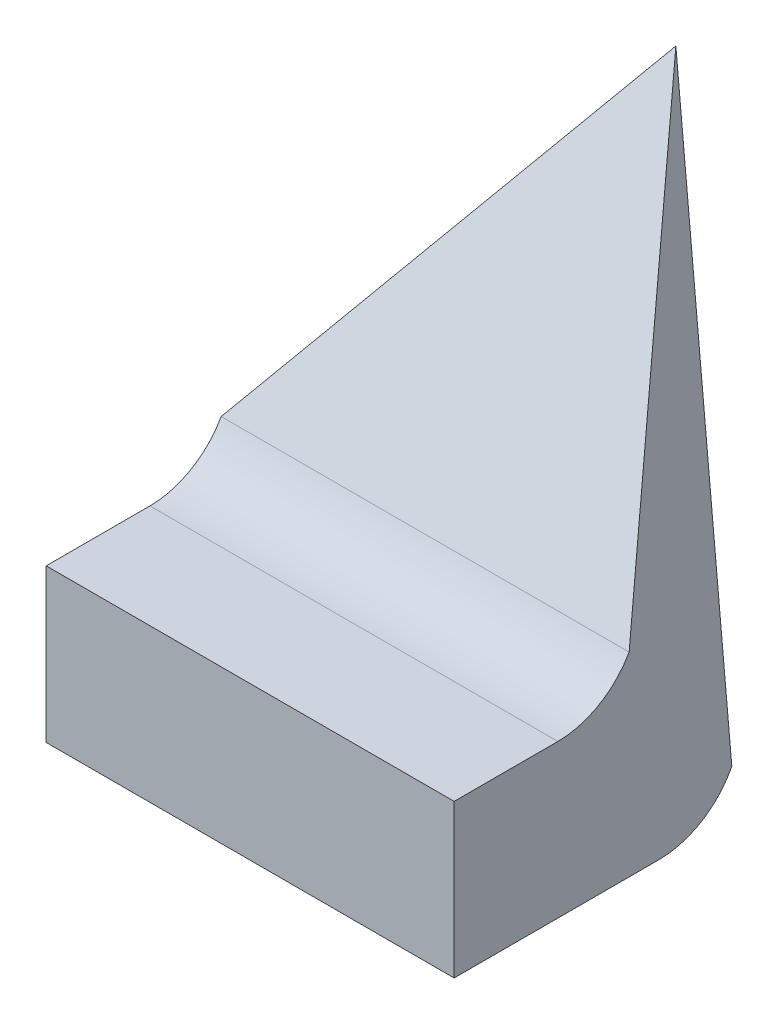
ISO-10303-21;
HEADER;
FILE_DESCRIPTION(('STEP AP214'),'2;1');
FILE_NAME('part.step','',(''),(''),'','','');
FILE_SCHEMA(('AUTOMOTIVE_DESIGN { 1 0 10303 214 1 1 1 1 }'));
ENDSEC;
DATA;
#1=APPLICATION_CONTEXT('core data for automotive mechanical design processes');
#2=APPLICATION_PROTOCOL_DEFINITION('international standard','automotive_design',2000,#1);
#3=PRODUCT_CONTEXT('',#1,'mechanical');
#4=PRODUCT('Part','Part','',(#3));
#5=PRODUCT_RELATED_PRODUCT_CATEGORY('part','',(#4));
#6=PRODUCT_DEFINITION_FORMATION('','',#4);
#7=PRODUCT_DEFINITION_CONTEXT('part definition',#1,'design');
#8=PRODUCT_DEFINITION('design','',#6,#7);
#9=PRODUCT_DEFINITION_SHAPE('','',#8);
#10=(LENGTH_UNIT() NAMED_UNIT(*) SI_UNIT(.MILLI.,.METRE.));
#11=(NAMED_UNIT(*) PLANE_ANGLE_UNIT() SI_UNIT($,.RADIAN.));
#12=(NAMED_UNIT(*) SI_UNIT($,.STERADIAN.) SOLID_ANGLE_UNIT());
#13=UNCERTAINTY_MEASURE_WITH_UNIT(LENGTH_MEASURE(1.E-05),#10,'distance_accuracy_value','');
#14=(GEOMETRIC_REPRESENTATION_CONTEXT(3) GLOBAL_UNCERTAINTY_ASSIGNED_CONTEXT((#13)) GLOBAL_UNIT_ASSIGNED_CONTEXT((#10,
#11,#12)) REPRESENTATION_CONTEXT('',''));
#15=CARTESIAN_POINT('',(0.,0.,0.));
#16=DIRECTION('',(0.,0.,1.));
#17=DIRECTION('',(1.,0.,0.));
#18=AXIS2_PLACEMENT_3D('',#15,#16,#17);
#19=CARTESIAN_POINT('',(-72.48907229268,21.89380350451,24.069563060296));
#20=DIRECTION('',(0.,0.455111059789055,0.890434682196108));
#21=DIRECTION('',(0.,-0.890434682196108,0.455111059789055));
#22=AXIS2_PLACEMENT_3D('',#19,#20,#21);
#23=PLANE('',#22);
#24=DIRECTION('',(1.,0.,0.));
#25=VECTOR('',#24,1.);
#26=CARTESIAN_POINT('',(-72.48907229268,21.8938035045101,24.0695630602962));
#27=LINE('',#26,#25);
#28=CARTESIAN_POINT('',(-72.48907229268,21.8938035045099,24.0695630602962));
#29=VERTEX_POINT('',#28);
#30=CARTESIAN_POINT('',(-72.08907229268,21.8938035045099,24.0695630602962));
#31=VERTEX_POINT('',#30);
#32=EDGE_CURVE('E83',#29,#31,#27,.T.);
#33=ORIENTED_EDGE('',*,*,#32,.F.);
#34=DIRECTION('',(0.,-0.890434682195813,0.455111059789631));
#35=VECTOR('',#34,1.);
#36=CARTESIAN_POINT('',(-72.48907229268,22.256621274076,23.884122866962));
#37=LINE('',#36,#35);
#38=CARTESIAN_POINT('',(-72.28907229268,22.3329201022555,23.9244295892155));
#39=VERTEX_POINT('',#38);
#40=EDGE_CURVE('E47',#39,#29,#37,.T.);
#41=ORIENTED_EDGE('',*,*,#40,.F.);
#42=DIRECTION('',(0.,-0.890434682195813,0.455111059789631));
#43=VECTOR('',#42,1.);
#44=CARTESIAN_POINT('',(-72.08907229268,22.256621274076,23.884122866962));
#45=LINE('',#44,#43);
#46=EDGE_CURVE('E97',#39,#31,#45,.T.);
#47=ORIENTED_EDGE('',*,*,#46,.T.);
#48=EDGE_LOOP('',(#33,#41,#47));
#49=FACE_BOUND('',#48,.T.);
#50=ADVANCED_FACE('F17',(#49),#23,.F.);
#51=CARTESIAN_POINT('',(-72.48907229268,21.930212389293,24.140797834872));
#52=DIRECTION('',(1.,0.,0.));
#53=DIRECTION('',(0.,0.,-1.));
#54=AXIS2_PLACEMENT_3D('',#51,#52,#53);
#55=CYLINDRICAL_SURFACE('',#54,0.08);
#56=CARTESIAN_POINT('',(-72.48907229268,21.930212389293,24.140797834872));
#57=DIRECTION('',(1.,0.,0.));
#58=DIRECTION('',(0.,0.,-1.));
#59=AXIS2_PLACEMENT_3D('',#56,#57,#58);
#60=CIRCLE('',#59,0.08);
#61=CARTESIAN_POINT('',(-72.48907229268,21.850212389293,24.140797834872));
#62=VERTEX_POINT('',#61);
#63=EDGE_CURVE('E20',#29,#62,#60,.F.);
#64=ORIENTED_EDGE('',*,*,#63,.F.);
#65=ORIENTED_EDGE('',*,*,#32,.T.);
#66=CARTESIAN_POINT('',(-72.08907229268,21.930212389293,24.140797834872));
#67=DIRECTION('',(1.,0.,0.));
#68=DIRECTION('',(0.,0.,-1.));
#69=AXIS2_PLACEMENT_3D('',#66,#67,#68);
#70=CIRCLE('',#69,0.08);
#71=CARTESIAN_POINT('',(-72.08907229268,21.850212389293,24.140797834872));
#72=VERTEX_POINT('',#71);
#73=EDGE_CURVE('E90',#31,#72,#70,.F.);
#74=ORIENTED_EDGE('',*,*,#73,.T.);
#75=DIRECTION('',(1.,0.,0.));
#76=VECTOR('',#75,1.);
#77=CARTESIAN_POINT('',(-72.48907229268,21.850212389293,24.140797834872));
#78=LINE('',#77,#76);
#79=EDGE_CURVE('E76',#72,#62,#78,.F.);
#80=ORIENTED_EDGE('',*,*,#79,.T.);
#81=EDGE_LOOP('',(#64,#65,#74,#80));
#82=FACE_BOUND('',#81,.T.);
#83=ADVANCED_FACE('F96',(#82),#55,.T.);
#84=CARTESIAN_POINT('',(-72.48907229268,21.850212389293,24.341842963629));
#85=DIRECTION('',(0.,1.,0.));
#86=DIRECTION('',(0.,0.,1.));
#87=AXIS2_PLACEMENT_3D('',#84,#85,#86);
#88=PLANE('',#87);
#89=DIRECTION('',(-1.,0.,0.));
#90=VECTOR('',#89,1.);
#91=CARTESIAN_POINT('',(-72.48907229268,21.850212389293,24.341842963629));
#92=LINE('',#91,#90);
#93=CARTESIAN_POINT('',(-72.08907229268,21.850212389293,24.341842963629));
#94=VERTEX_POINT('',#93);
#95=CARTESIAN_POINT('',(-72.48907229268,21.850212389293,24.341842963629));
#96=VERTEX_POINT('',#95);
#97=EDGE_CURVE('E82',#94,#96,#92,.T.);
#98=ORIENTED_EDGE('',*,*,#97,.T.);
#99=DIRECTION('',(0.,0.,1.));
#100=VECTOR('',#99,1.);
#101=CARTESIAN_POINT('',(-72.48907229268,21.850212389293,23.894890125116));
#102=LINE('',#101,#100);
#103=EDGE_CURVE('E57',#62,#96,#102,.T.);
#104=ORIENTED_EDGE('',*,*,#103,.F.);
#105=ORIENTED_EDGE('',*,*,#79,.F.);
#106=DIRECTION('',(0.,0.,1.));
#107=VECTOR('',#106,1.);
#108=CARTESIAN_POINT('',(-72.08907229268,21.850212389293,23.894890125116));
#109=LINE('',#108,#107);
#110=EDGE_CURVE('E79',#72,#94,#109,.T.);
#111=ORIENTED_EDGE('',*,*,#110,.T.);
#112=EDGE_LOOP('',(#98,#104,#105,#111));
#113=FACE_BOUND('',#112,.T.);
#114=ADVANCED_FACE('F78',(#113),#88,.F.);
#115=CARTESIAN_POINT('',(-72.48907229268,22.000212389293,24.341842963629));
#116=DIRECTION('',(0.,0.,-1.));
#117=DIRECTION('',(-1.,0.,0.));
#118=AXIS2_PLACEMENT_3D('',#115,#116,#117);
#119=PLANE('',#118);
#120=DIRECTION('',(1.,0.,0.));
#121=VECTOR('',#120,1.);
#122=CARTESIAN_POINT('',(-72.48907229268,22.000212389293,24.341842963629));
#123=LINE('',#122,#121);
#124=CARTESIAN_POINT('',(-72.08907229268,22.000212389293,24.341842963629));
#125=VERTEX_POINT('',#124);
#126=CARTESIAN_POINT('',(-72.48907229268,22.000212389293,24.341842963629));
#127=VERTEX_POINT('',#126);
#128=EDGE_CURVE('E123',#125,#127,#123,.F.);
#129=ORIENTED_EDGE('',*,*,#128,.T.);
#130=DIRECTION('',(0.,1.,0.));
#131=VECTOR('',#130,1.);
#132=CARTESIAN_POINT('',(-72.48907229268,22.370212389293,24.341842963629));
#133=LINE('',#132,#131);
#134=EDGE_CURVE('E104',#96,#127,#133,.T.);
#135=ORIENTED_EDGE('',*,*,#134,.F.);
#136=ORIENTED_EDGE('',*,*,#97,.F.);
#137=DIRECTION('',(0.,1.,0.));
#138=VECTOR('',#137,1.);
#139=CARTESIAN_POINT('',(-72.08907229268,22.370212389293,24.341842963629));
#140=LINE('',#139,#138);
#141=EDGE_CURVE('E94',#94,#125,#140,.T.);
#142=ORIENTED_EDGE('',*,*,#141,.T.);
#143=EDGE_LOOP('',(#129,#135,#136,#142));
#144=FACE_BOUND('',#143,.T.);
#145=ADVANCED_FACE('F138',(#144),#119,.F.);
#146=CARTESIAN_POINT('',(-72.48907229268,22.000212389293,24.240104347825));
#147=DIRECTION('',(0.,-1.,0.));
#148=DIRECTION('',(0.,0.,-1.));
#149=AXIS2_PLACEMENT_3D('',#146,#147,#148);
#150=PLANE('',#149);
#151=DIRECTION('',(1.,0.,0.));
#152=VECTOR('',#151,1.);
#153=CARTESIAN_POINT('',(-72.48907229268,22.000212389293,24.240104347825));
#154=LINE('',#153,#152);
#155=CARTESIAN_POINT('',(-72.08907229268,22.000212389293,24.240104347825));
#156=VERTEX_POINT('',#155);
#157=CARTESIAN_POINT('',(-72.48907229268,22.000212389293,24.240104347825));
#158=VERTEX_POINT('',#157);
#159=EDGE_CURVE('E119',#156,#158,#154,.F.);
#160=ORIENTED_EDGE('',*,*,#159,.T.);
#161=DIRECTION('',(0.,0.,1.));
#162=VECTOR('',#161,1.);
#163=CARTESIAN_POINT('',(-72.48907229268,22.000212389293,23.894890125116));
#164=LINE('',#163,#162);
#165=EDGE_CURVE('E103',#127,#158,#164,.F.);
#166=ORIENTED_EDGE('',*,*,#165,.F.);
#167=ORIENTED_EDGE('',*,*,#128,.F.);
#168=DIRECTION('',(0.,0.,1.));
#169=VECTOR('',#168,1.);
#170=CARTESIAN_POINT('',(-72.08907229268,22.000212389293,23.894890125116));
#171=LINE('',#170,#169);
#172=EDGE_CURVE('E129',#125,#156,#171,.F.);
#173=ORIENTED_EDGE('',*,*,#172,.T.);
#174=EDGE_LOOP('',(#160,#166,#167,#173));
#175=FACE_BOUND('',#174,.T.);
#176=ADVANCED_FACE('F151',(#175),#150,.F.);
#177=CARTESIAN_POINT('',(-72.48907229268,22.080212389293,24.240104347825));
#178=DIRECTION('',(1.,0.,0.));
#179=DIRECTION('',(0.,0.,-1.));
#180=AXIS2_PLACEMENT_3D('',#177,#178,#179);
#181=CYLINDRICAL_SURFACE('',#180,0.08);
#182=DIRECTION('',(1.,0.,0.));
#183=VECTOR('',#182,1.);
#184=CARTESIAN_POINT('',(-72.48907229268,22.0412058481508,24.1702581614707));
#185=LINE('',#184,#183);
#186=CARTESIAN_POINT('',(-72.08907229268,22.0412058481507,24.1702581614708));
#187=VERTEX_POINT('',#186);
#188=CARTESIAN_POINT('',(-72.48907229268,22.0412058481507,24.1702581614708));
#189=VERTEX_POINT('',#188);
#190=EDGE_CURVE('E161',#187,#189,#185,.F.);
#191=ORIENTED_EDGE('',*,*,#190,.T.);
#192=CARTESIAN_POINT('',(-72.48907229268,22.080212389293,24.240104347825));
#193=DIRECTION('',(1.,0.,0.));
#194=DIRECTION('',(0.,0.,-1.));
#195=AXIS2_PLACEMENT_3D('',#192,#193,#194);
#196=CIRCLE('',#195,0.08);
#197=EDGE_CURVE('E35',#158,#189,#196,.T.);
#198=ORIENTED_EDGE('',*,*,#197,.F.);
#199=ORIENTED_EDGE('',*,*,#159,.F.);
#200=CARTESIAN_POINT('',(-72.08907229268,22.080212389293,24.240104347825));
#201=DIRECTION('',(1.,0.,0.));
#202=DIRECTION('',(0.,0.,-1.));
#203=AXIS2_PLACEMENT_3D('',#200,#201,#202);
#204=CIRCLE('',#203,0.08);
#205=EDGE_CURVE('E101',#156,#187,#204,.T.);
#206=ORIENTED_EDGE('',*,*,#205,.T.);
#207=EDGE_LOOP('',(#191,#198,#199,#206));
#208=FACE_BOUND('',#207,.T.);
#209=ADVANCED_FACE('F142',(#208),#181,.F.);
#210=CARTESIAN_POINT('',(-72.48907229268,22.370212389293,23.894890125116));
#211=DIRECTION('',(-1.,0.,0.));
#212=DIRECTION('',(0.,0.,1.));
#213=AXIS2_PLACEMENT_3D('',#210,#211,#212);
#214=PLANE('',#213);
#215=DIRECTION('',(0.,0.873077329419039,-0.487581764276022));
#216=VECTOR('',#215,1.);
#217=CARTESIAN_POINT('',(-72.48907229268,22.409218930435,23.964736311469));
#218=LINE('',#217,#216);
#219=EDGE_CURVE('E26',#189,#39,#218,.T.);
#220=ORIENTED_EDGE('',*,*,#219,.T.);
#221=ORIENTED_EDGE('',*,*,#40,.T.);
#222=ORIENTED_EDGE('',*,*,#63,.T.);
#223=ORIENTED_EDGE('',*,*,#103,.T.);
#224=ORIENTED_EDGE('',*,*,#134,.T.);
#225=ORIENTED_EDGE('',*,*,#165,.T.);
#226=ORIENTED_EDGE('',*,*,#197,.T.);
#227=EDGE_LOOP('',(#220,#221,#222,#223,#224,#225,#226));
#228=FACE_BOUND('',#227,.T.);
#229=ADVANCED_FACE('F140',(#228),#214,.T.);
#230=CARTESIAN_POINT('',(-72.08907229268,22.370212389293,23.894890125116));
#231=DIRECTION('',(-1.,0.,0.));
#232=DIRECTION('',(0.,0.,1.));
#233=AXIS2_PLACEMENT_3D('',#230,#231,#232);
#234=PLANE('',#233);
#235=DIRECTION('',(0.,0.873077329419039,-0.487581764276022));
#236=VECTOR('',#235,1.);
#237=CARTESIAN_POINT('',(-72.08907229268,22.409218930435,23.964736311469));
#238=LINE('',#237,#236);
#239=EDGE_CURVE('E11',#39,#187,#238,.F.);
#240=ORIENTED_EDGE('',*,*,#239,.T.);
#241=ORIENTED_EDGE('',*,*,#205,.F.);
#242=ORIENTED_EDGE('',*,*,#172,.F.);
#243=ORIENTED_EDGE('',*,*,#141,.F.);
#244=ORIENTED_EDGE('',*,*,#110,.F.);
#245=ORIENTED_EDGE('',*,*,#73,.F.);
#246=ORIENTED_EDGE('',*,*,#46,.F.);
#247=EDGE_LOOP('',(#240,#241,#242,#243,#244,#245,#246));
#248=FACE_BOUND('',#247,.T.);
#249=ADVANCED_FACE('F88',(#248),#234,.F.);
#250=CARTESIAN_POINT('',(-72.48907229268,22.409218930435,23.964736311469));
#251=DIRECTION('',(0.,-0.487581764276022,-0.873077329419039));
#252=DIRECTION('',(0.,0.873077329419039,-0.487581764276022));
#253=AXIS2_PLACEMENT_3D('',#250,#251,#252);
#254=PLANE('',#253);
#255=ORIENTED_EDGE('',*,*,#219,.F.);
#256=ORIENTED_EDGE('',*,*,#190,.F.);
#257=ORIENTED_EDGE('',*,*,#239,.F.);
#258=EDGE_LOOP('',(#255,#256,#257));
#259=FACE_BOUND('',#258,.T.);
#260=ADVANCED_FACE('F149',(#259),#254,.F.);
#261=CLOSED_SHELL('',(#50,#83,#114,#145,#176,#209,#229,#249,#260));
#262=MANIFOLD_SOLID_BREP('B1',#261);
#263=ADVANCED_BREP_SHAPE_REPRESENTATION('',(#18,#262),#14);
#264=SHAPE_DEFINITION_REPRESENTATION(#9,#263);
ENDSEC;
END-ISO-10303-21;
